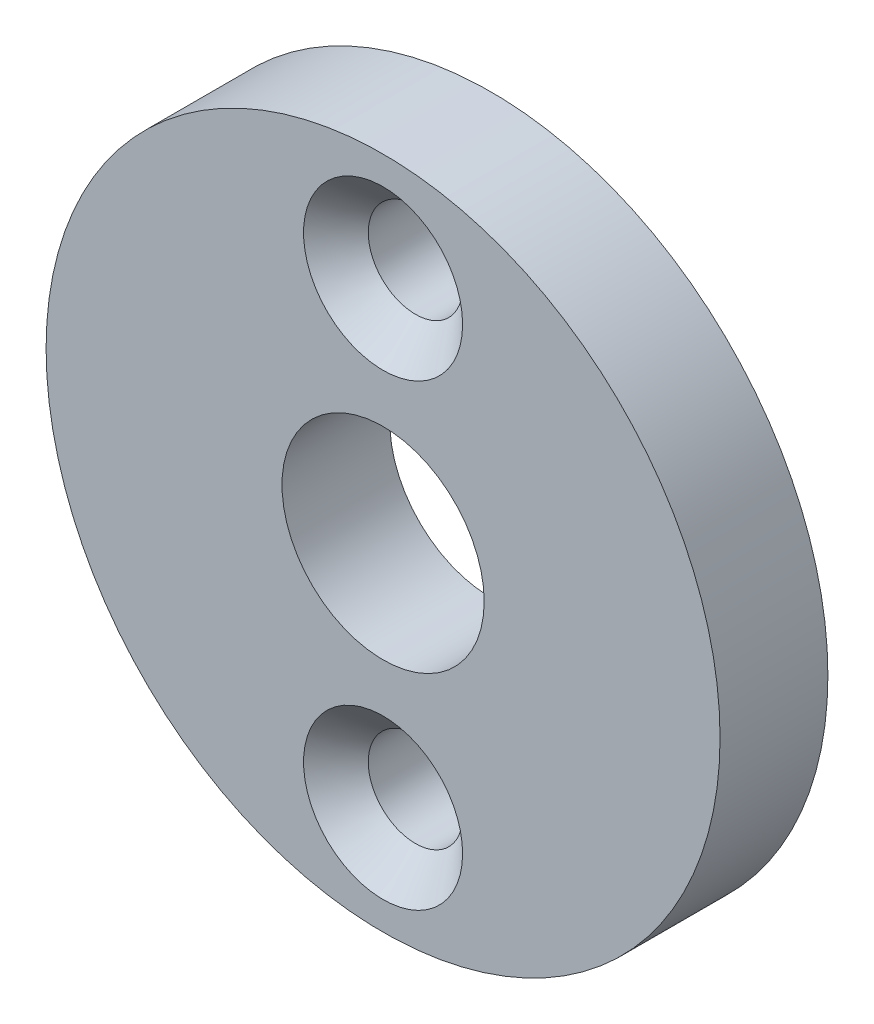
ISO-10303-21;
HEADER;
FILE_DESCRIPTION(('STEP AP214'),'2;1');
FILE_NAME('part.step','',(''),(''),'','','');
FILE_SCHEMA(('AUTOMOTIVE_DESIGN { 1 0 10303 214 1 1 1 1 }'));
ENDSEC;
DATA;
#1=APPLICATION_CONTEXT('core data for automotive mechanical design processes');
#2=APPLICATION_PROTOCOL_DEFINITION('international standard','automotive_design',2000,#1);
#3=PRODUCT_CONTEXT('',#1,'mechanical');
#4=PRODUCT('Part','Part','',(#3));
#5=PRODUCT_RELATED_PRODUCT_CATEGORY('part','',(#4));
#6=PRODUCT_DEFINITION_FORMATION('','',#4);
#7=PRODUCT_DEFINITION_CONTEXT('part definition',#1,'design');
#8=PRODUCT_DEFINITION('design','',#6,#7);
#9=PRODUCT_DEFINITION_SHAPE('','',#8);
#10=(LENGTH_UNIT() NAMED_UNIT(*) SI_UNIT(.MILLI.,.METRE.));
#11=(NAMED_UNIT(*) PLANE_ANGLE_UNIT() SI_UNIT($,.RADIAN.));
#12=(NAMED_UNIT(*) SI_UNIT($,.STERADIAN.) SOLID_ANGLE_UNIT());
#13=UNCERTAINTY_MEASURE_WITH_UNIT(LENGTH_MEASURE(1.E-05),#10,'distance_accuracy_value','');
#14=(GEOMETRIC_REPRESENTATION_CONTEXT(3) GLOBAL_UNCERTAINTY_ASSIGNED_CONTEXT((#13)) GLOBAL_UNIT_ASSIGNED_CONTEXT((#10,
#11,#12)) REPRESENTATION_CONTEXT('',''));
#15=CARTESIAN_POINT('',(0.,0.,0.));
#16=DIRECTION('',(0.,0.,1.));
#17=DIRECTION('',(1.,0.,0.));
#18=AXIS2_PLACEMENT_3D('',#15,#16,#17);
#19=CARTESIAN_POINT('',(30.875,0.,4.));
#20=DIRECTION('',(0.,0.,1.));
#21=DIRECTION('',(1.,0.,0.));
#22=AXIS2_PLACEMENT_3D('',#19,#20,#21);
#23=PLANE('',#22);
#24=CARTESIAN_POINT('',(30.875,-8.5,4.));
#25=DIRECTION('',(0.,0.,1.));
#26=DIRECTION('',(1.,0.,0.));
#27=AXIS2_PLACEMENT_3D('',#24,#25,#26);
#28=CIRCLE('',#27,2.95);
#29=CARTESIAN_POINT('',(33.825,-8.5,4.));
#30=VERTEX_POINT('',#29);
#31=EDGE_CURVE('E40',#30,#30,#28,.F.);
#32=ORIENTED_EDGE('',*,*,#31,.T.);
#33=EDGE_LOOP('',(#32));
#34=FACE_BOUND('',#33,.T.);
#35=CARTESIAN_POINT('',(30.875,8.5,4.));
#36=DIRECTION('',(0.,0.,1.));
#37=DIRECTION('',(1.,0.,0.));
#38=AXIS2_PLACEMENT_3D('',#35,#36,#37);
#39=CIRCLE('',#38,2.95);
#40=CARTESIAN_POINT('',(33.825,8.5,4.));
#41=VERTEX_POINT('',#40);
#42=EDGE_CURVE('E44',#41,#41,#39,.F.);
#43=ORIENTED_EDGE('',*,*,#42,.T.);
#44=EDGE_LOOP('',(#43));
#45=FACE_BOUND('',#44,.T.);
#46=CARTESIAN_POINT('',(30.875,0.,4.));
#47=DIRECTION('',(0.,0.,1.));
#48=DIRECTION('',(1.,0.,0.));
#49=AXIS2_PLACEMENT_3D('',#46,#47,#48);
#50=CIRCLE('',#49,12.5);
#51=CARTESIAN_POINT('',(43.375,0.,4.));
#52=VERTEX_POINT('',#51);
#53=EDGE_CURVE('E53',#52,#52,#50,.T.);
#54=ORIENTED_EDGE('',*,*,#53,.T.);
#55=EDGE_LOOP('',(#54));
#56=FACE_BOUND('',#55,.T.);
#57=CARTESIAN_POINT('',(30.875,0.,4.));
#58=DIRECTION('',(0.,0.,1.));
#59=DIRECTION('',(1.,0.,0.));
#60=AXIS2_PLACEMENT_3D('',#57,#58,#59);
#61=CIRCLE('',#60,3.75000000000001);
#62=CARTESIAN_POINT('',(34.625,0.,4.));
#63=VERTEX_POINT('',#62);
#64=EDGE_CURVE('E65',#63,#63,#61,.T.);
#65=ORIENTED_EDGE('',*,*,#64,.F.);
#66=EDGE_LOOP('',(#65));
#67=FACE_BOUND('',#66,.T.);
#68=ADVANCED_FACE('F33',(#34,#45,#56,#67),#23,.T.);
#69=CARTESIAN_POINT('',(30.875,0.,0.));
#70=DIRECTION('',(0.,0.,1.));
#71=DIRECTION('',(1.,0.,0.));
#72=AXIS2_PLACEMENT_3D('',#69,#70,#71);
#73=PLANE('',#72);
#74=CARTESIAN_POINT('',(30.875,0.,0.));
#75=DIRECTION('',(0.,0.,1.));
#76=DIRECTION('',(1.,0.,0.));
#77=AXIS2_PLACEMENT_3D('',#74,#75,#76);
#78=CIRCLE('',#77,12.5);
#79=CARTESIAN_POINT('',(43.375,0.,0.));
#80=VERTEX_POINT('',#79);
#81=EDGE_CURVE('E54',#80,#80,#78,.T.);
#82=ORIENTED_EDGE('',*,*,#81,.F.);
#83=EDGE_LOOP('',(#82));
#84=FACE_BOUND('',#83,.T.);
#85=CARTESIAN_POINT('',(30.875,8.5,0.));
#86=DIRECTION('',(0.,0.,1.));
#87=DIRECTION('',(1.,0.,0.));
#88=AXIS2_PLACEMENT_3D('',#85,#86,#87);
#89=CIRCLE('',#88,1.75);
#90=CARTESIAN_POINT('',(32.625,8.5,0.));
#91=VERTEX_POINT('',#90);
#92=EDGE_CURVE('E57',#91,#91,#89,.T.);
#93=ORIENTED_EDGE('',*,*,#92,.T.);
#94=EDGE_LOOP('',(#93));
#95=FACE_BOUND('',#94,.T.);
#96=CARTESIAN_POINT('',(30.875,-8.5,0.));
#97=DIRECTION('',(0.,0.,1.));
#98=DIRECTION('',(1.,0.,0.));
#99=AXIS2_PLACEMENT_3D('',#96,#97,#98);
#100=CIRCLE('',#99,1.75);
#101=CARTESIAN_POINT('',(32.625,-8.5,0.));
#102=VERTEX_POINT('',#101);
#103=EDGE_CURVE('E62',#102,#102,#100,.T.);
#104=ORIENTED_EDGE('',*,*,#103,.T.);
#105=EDGE_LOOP('',(#104));
#106=FACE_BOUND('',#105,.T.);
#107=CARTESIAN_POINT('',(30.875,0.,0.));
#108=DIRECTION('',(0.,0.,1.));
#109=DIRECTION('',(1.,0.,0.));
#110=AXIS2_PLACEMENT_3D('',#107,#108,#109);
#111=CIRCLE('',#110,3.75000000000001);
#112=CARTESIAN_POINT('',(34.625,0.,0.));
#113=VERTEX_POINT('',#112);
#114=EDGE_CURVE('E66',#113,#113,#111,.T.);
#115=ORIENTED_EDGE('',*,*,#114,.T.);
#116=EDGE_LOOP('',(#115));
#117=FACE_BOUND('',#116,.T.);
#118=ADVANCED_FACE('F76',(#84,#95,#106,#117),#73,.F.);
#119=CARTESIAN_POINT('',(30.875,0.,4.));
#120=DIRECTION('',(0.,0.,-1.));
#121=DIRECTION('',(-1.,0.,0.));
#122=AXIS2_PLACEMENT_3D('',#119,#120,#121);
#123=CYLINDRICAL_SURFACE('',#122,12.5);
#124=ORIENTED_EDGE('',*,*,#53,.F.);
#125=EDGE_LOOP('',(#124));
#126=FACE_BOUND('',#125,.T.);
#127=ORIENTED_EDGE('',*,*,#81,.T.);
#128=EDGE_LOOP('',(#127));
#129=FACE_BOUND('',#128,.T.);
#130=ADVANCED_FACE('F81',(#126,#129),#123,.T.);
#131=CARTESIAN_POINT('',(30.875,8.5,4.));
#132=DIRECTION('',(0.,0.,-1.));
#133=DIRECTION('',(-1.,0.,0.));
#134=AXIS2_PLACEMENT_3D('',#131,#132,#133);
#135=CYLINDRICAL_SURFACE('',#134,1.75);
#136=CARTESIAN_POINT('',(30.875,8.5,2.80000000000001));
#137=DIRECTION('',(0.,0.,1.));
#138=DIRECTION('',(1.,0.,0.));
#139=AXIS2_PLACEMENT_3D('',#136,#137,#138);
#140=CIRCLE('',#139,1.75);
#141=CARTESIAN_POINT('',(32.625,8.5,2.80000000000001));
#142=VERTEX_POINT('',#141);
#143=EDGE_CURVE('E10',#142,#142,#140,.T.);
#144=ORIENTED_EDGE('',*,*,#143,.T.);
#145=EDGE_LOOP('',(#144));
#146=FACE_BOUND('',#145,.T.);
#147=ORIENTED_EDGE('',*,*,#92,.F.);
#148=EDGE_LOOP('',(#147));
#149=FACE_BOUND('',#148,.T.);
#150=ADVANCED_FACE('F86',(#146,#149),#135,.F.);
#151=CARTESIAN_POINT('',(30.875,-8.5,4.));
#152=DIRECTION('',(0.,0.,-1.));
#153=DIRECTION('',(-1.,0.,0.));
#154=AXIS2_PLACEMENT_3D('',#151,#152,#153);
#155=CYLINDRICAL_SURFACE('',#154,1.75);
#156=CARTESIAN_POINT('',(30.875,-8.5,2.80000000000001));
#157=DIRECTION('',(0.,0.,1.));
#158=DIRECTION('',(1.,0.,0.));
#159=AXIS2_PLACEMENT_3D('',#156,#157,#158);
#160=CIRCLE('',#159,1.75);
#161=CARTESIAN_POINT('',(32.625,-8.5,2.80000000000001));
#162=VERTEX_POINT('',#161);
#163=EDGE_CURVE('E48',#162,#162,#160,.T.);
#164=ORIENTED_EDGE('',*,*,#163,.T.);
#165=EDGE_LOOP('',(#164));
#166=FACE_BOUND('',#165,.T.);
#167=ORIENTED_EDGE('',*,*,#103,.F.);
#168=EDGE_LOOP('',(#167));
#169=FACE_BOUND('',#168,.T.);
#170=ADVANCED_FACE('F99',(#166,#169),#155,.F.);
#171=CARTESIAN_POINT('',(30.875,0.,4.));
#172=DIRECTION('',(0.,0.,-1.));
#173=DIRECTION('',(-1.,0.,0.));
#174=AXIS2_PLACEMENT_3D('',#171,#172,#173);
#175=CYLINDRICAL_SURFACE('',#174,3.75000000000001);
#176=ORIENTED_EDGE('',*,*,#64,.T.);
#177=EDGE_LOOP('',(#176));
#178=FACE_BOUND('',#177,.T.);
#179=ORIENTED_EDGE('',*,*,#114,.F.);
#180=EDGE_LOOP('',(#179));
#181=FACE_BOUND('',#180,.T.);
#182=ADVANCED_FACE('F72',(#178,#181),#175,.F.);
#183=CARTESIAN_POINT('',(30.875,-8.5,2.80000000000001));
#184=DIRECTION('',(0.,0.,1.));
#185=DIRECTION('',(1.,0.,0.));
#186=AXIS2_PLACEMENT_3D('',#183,#184,#185);
#187=CONICAL_SURFACE('',#186,1.75,0.785398163397451);
#188=ORIENTED_EDGE('',*,*,#31,.F.);
#189=EDGE_LOOP('',(#188));
#190=FACE_BOUND('',#189,.T.);
#191=ORIENTED_EDGE('',*,*,#163,.F.);
#192=EDGE_LOOP('',(#191));
#193=FACE_BOUND('',#192,.T.);
#194=ADVANCED_FACE('F91',(#190,#193),#187,.F.);
#195=CARTESIAN_POINT('',(30.875,8.5,2.80000000000001));
#196=DIRECTION('',(0.,0.,1.));
#197=DIRECTION('',(1.,0.,0.));
#198=AXIS2_PLACEMENT_3D('',#195,#196,#197);
#199=CONICAL_SURFACE('',#198,1.75,0.785398163397451);
#200=ORIENTED_EDGE('',*,*,#42,.F.);
#201=EDGE_LOOP('',(#200));
#202=FACE_BOUND('',#201,.T.);
#203=ORIENTED_EDGE('',*,*,#143,.F.);
#204=EDGE_LOOP('',(#203));
#205=FACE_BOUND('',#204,.T.);
#206=ADVANCED_FACE('F35',(#202,#205),#199,.F.);
#207=CLOSED_SHELL('',(#68,#118,#130,#150,#170,#182,#194,#206));
#208=MANIFOLD_SOLID_BREP('B2',#207);
#209=ADVANCED_BREP_SHAPE_REPRESENTATION('',(#18,#208),#14);
#210=SHAPE_DEFINITION_REPRESENTATION(#9,#209);
ENDSEC;
END-ISO-10303-21;
